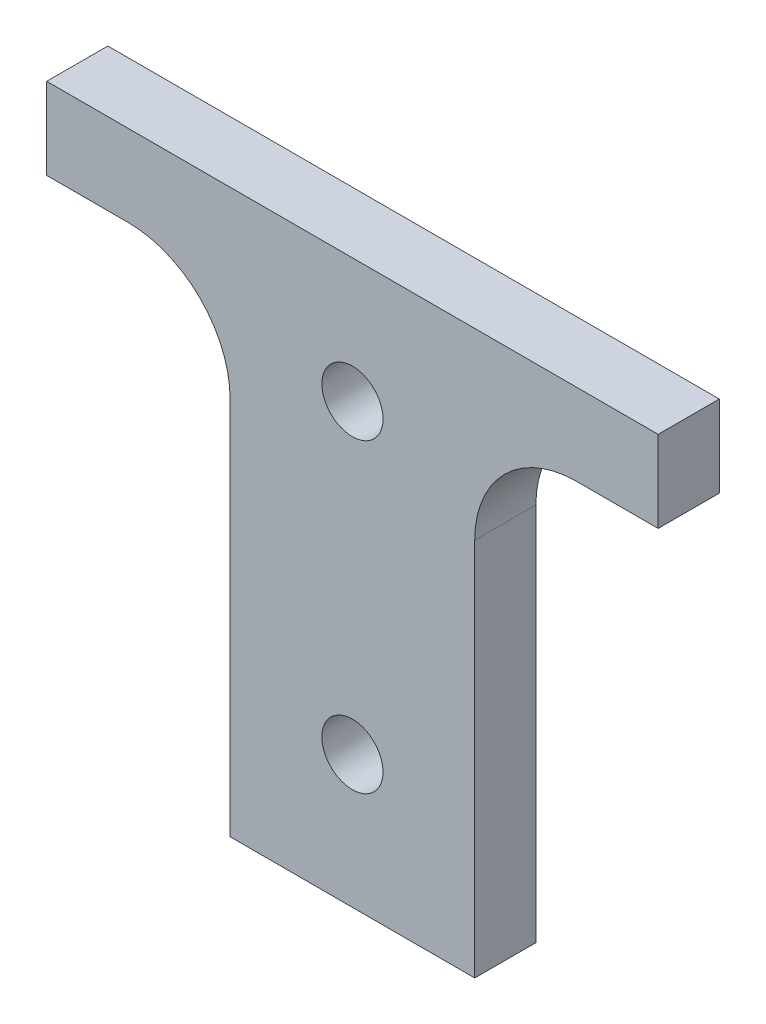
ISO-10303-21;
HEADER;
FILE_DESCRIPTION(('STEP AP214'),'2;1');
FILE_NAME('part.step','',(''),(''),'','','');
FILE_SCHEMA(('AUTOMOTIVE_DESIGN { 1 0 10303 214 1 1 1 1 }'));
ENDSEC;
DATA;
#1=APPLICATION_CONTEXT('core data for automotive mechanical design processes');
#2=APPLICATION_PROTOCOL_DEFINITION('international standard','automotive_design',2000,#1);
#3=PRODUCT_CONTEXT('',#1,'mechanical');
#4=PRODUCT('Part','Part','',(#3));
#5=PRODUCT_RELATED_PRODUCT_CATEGORY('part','',(#4));
#6=PRODUCT_DEFINITION_FORMATION('','',#4);
#7=PRODUCT_DEFINITION_CONTEXT('part definition',#1,'design');
#8=PRODUCT_DEFINITION('design','',#6,#7);
#9=PRODUCT_DEFINITION_SHAPE('','',#8);
#10=(LENGTH_UNIT() NAMED_UNIT(*) SI_UNIT(.MILLI.,.METRE.));
#11=(NAMED_UNIT(*) PLANE_ANGLE_UNIT() SI_UNIT($,.RADIAN.));
#12=(NAMED_UNIT(*) SI_UNIT($,.STERADIAN.) SOLID_ANGLE_UNIT());
#13=UNCERTAINTY_MEASURE_WITH_UNIT(LENGTH_MEASURE(1.E-05),#10,'distance_accuracy_value','');
#14=(GEOMETRIC_REPRESENTATION_CONTEXT(3) GLOBAL_UNCERTAINTY_ASSIGNED_CONTEXT((#13)) GLOBAL_UNIT_ASSIGNED_CONTEXT((#10,
#11,#12)) REPRESENTATION_CONTEXT('',''));
#15=CARTESIAN_POINT('',(0.,0.,0.));
#16=DIRECTION('',(0.,0.,1.));
#17=DIRECTION('',(1.,0.,0.));
#18=AXIS2_PLACEMENT_3D('',#15,#16,#17);
#19=CARTESIAN_POINT('',(0.,0.,3.));
#20=DIRECTION('',(0.,0.,1.));
#21=DIRECTION('',(1.,0.,0.));
#22=AXIS2_PLACEMENT_3D('',#19,#20,#21);
#23=PLANE('',#22);
#24=CARTESIAN_POINT('',(0.,6.5,3.));
#25=DIRECTION('',(0.,0.,1.));
#26=DIRECTION('',(1.,0.,0.));
#27=AXIS2_PLACEMENT_3D('',#24,#25,#26);
#28=CIRCLE('',#27,1.5);
#29=CARTESIAN_POINT('',(1.5,6.5,3.));
#30=VERTEX_POINT('',#29);
#31=EDGE_CURVE('E150',#30,#30,#28,.T.);
#32=ORIENTED_EDGE('',*,*,#31,.F.);
#33=EDGE_LOOP('',(#32));
#34=FACE_BOUND('',#33,.T.);
#35=DIRECTION('',(0.,1.,0.));
#36=VECTOR('',#35,1.);
#37=CARTESIAN_POINT('',(6.,0.,3.));
#38=LINE('',#37,#36);
#39=CARTESIAN_POINT('',(6.,0.,3.));
#40=VERTEX_POINT('',#39);
#41=CARTESIAN_POINT('',(6.,18.6,3.));
#42=VERTEX_POINT('',#41);
#43=EDGE_CURVE('E119',#40,#42,#38,.T.);
#44=ORIENTED_EDGE('',*,*,#43,.T.);
#45=CARTESIAN_POINT('',(11.,18.6,3.));
#46=DIRECTION('',(0.,0.,1.));
#47=DIRECTION('',(1.,0.,0.));
#48=AXIS2_PLACEMENT_3D('',#45,#46,#47);
#49=CIRCLE('',#48,5.);
#50=CARTESIAN_POINT('',(11.,23.6,3.));
#51=VERTEX_POINT('',#50);
#52=EDGE_CURVE('E11',#42,#51,#49,.F.);
#53=ORIENTED_EDGE('',*,*,#52,.T.);
#54=DIRECTION('',(1.,0.,0.));
#55=VECTOR('',#54,1.);
#56=CARTESIAN_POINT('',(15.,23.6,3.));
#57=LINE('',#56,#55);
#58=CARTESIAN_POINT('',(15.,23.6,3.));
#59=VERTEX_POINT('',#58);
#60=EDGE_CURVE('E109',#51,#59,#57,.T.);
#61=ORIENTED_EDGE('',*,*,#60,.T.);
#62=DIRECTION('',(0.,1.,0.));
#63=VECTOR('',#62,1.);
#64=CARTESIAN_POINT('',(15.,27.6,3.));
#65=LINE('',#64,#63);
#66=CARTESIAN_POINT('',(15.,27.6,3.));
#67=VERTEX_POINT('',#66);
#68=EDGE_CURVE('E113',#59,#67,#65,.T.);
#69=ORIENTED_EDGE('',*,*,#68,.T.);
#70=DIRECTION('',(-1.,0.,0.));
#71=VECTOR('',#70,1.);
#72=CARTESIAN_POINT('',(15.,27.6,3.));
#73=LINE('',#72,#71);
#74=CARTESIAN_POINT('',(-15.,27.6,3.));
#75=VERTEX_POINT('',#74);
#76=EDGE_CURVE('E133',#67,#75,#73,.T.);
#77=ORIENTED_EDGE('',*,*,#76,.T.);
#78=DIRECTION('',(0.,-1.,0.));
#79=VECTOR('',#78,1.);
#80=CARTESIAN_POINT('',(-15.,27.6,3.));
#81=LINE('',#80,#79);
#82=CARTESIAN_POINT('',(-15.,23.6,3.));
#83=VERTEX_POINT('',#82);
#84=EDGE_CURVE('E135',#75,#83,#81,.T.);
#85=ORIENTED_EDGE('',*,*,#84,.T.);
#86=DIRECTION('',(1.,0.,0.));
#87=VECTOR('',#86,1.);
#88=CARTESIAN_POINT('',(-15.,23.6,3.));
#89=LINE('',#88,#87);
#90=CARTESIAN_POINT('',(-11.,23.6,3.));
#91=VERTEX_POINT('',#90);
#92=EDGE_CURVE('E140',#83,#91,#89,.T.);
#93=ORIENTED_EDGE('',*,*,#92,.T.);
#94=CARTESIAN_POINT('',(-11.,18.6,3.));
#95=DIRECTION('',(0.,0.,1.));
#96=DIRECTION('',(1.,0.,0.));
#97=AXIS2_PLACEMENT_3D('',#94,#95,#96);
#98=CIRCLE('',#97,5.);
#99=CARTESIAN_POINT('',(-6.,18.6,3.));
#100=VERTEX_POINT('',#99);
#101=EDGE_CURVE('E183',#91,#100,#98,.F.);
#102=ORIENTED_EDGE('',*,*,#101,.T.);
#103=DIRECTION('',(0.,-1.,0.));
#104=VECTOR('',#103,1.);
#105=CARTESIAN_POINT('',(-6.,0.,3.));
#106=LINE('',#105,#104);
#107=CARTESIAN_POINT('',(-6.,0.,3.));
#108=VERTEX_POINT('',#107);
#109=EDGE_CURVE('E143',#100,#108,#106,.T.);
#110=ORIENTED_EDGE('',*,*,#109,.T.);
#111=DIRECTION('',(1.,0.,0.));
#112=VECTOR('',#111,1.);
#113=CARTESIAN_POINT('',(6.,0.,3.));
#114=LINE('',#113,#112);
#115=EDGE_CURVE('E145',#108,#40,#114,.T.);
#116=ORIENTED_EDGE('',*,*,#115,.T.);
#117=EDGE_LOOP('',(#44,#53,#61,#69,#77,#85,#93,#102,#110,#116));
#118=FACE_BOUND('',#117,.T.);
#119=CARTESIAN_POINT('',(0.,21.5,3.));
#120=DIRECTION('',(0.,0.,1.));
#121=DIRECTION('',(1.,0.,0.));
#122=AXIS2_PLACEMENT_3D('',#119,#120,#121);
#123=CIRCLE('',#122,1.5);
#124=CARTESIAN_POINT('',(1.5,21.5,3.));
#125=VERTEX_POINT('',#124);
#126=EDGE_CURVE('E338',#125,#125,#123,.T.);
#127=ORIENTED_EDGE('',*,*,#126,.F.);
#128=EDGE_LOOP('',(#127));
#129=FACE_BOUND('',#128,.T.);
#130=ADVANCED_FACE('F33',(#34,#118,#129),#23,.T.);
#131=CARTESIAN_POINT('',(0.,0.,0.));
#132=DIRECTION('',(0.,0.,1.));
#133=DIRECTION('',(1.,0.,0.));
#134=AXIS2_PLACEMENT_3D('',#131,#132,#133);
#135=PLANE('',#134);
#136=DIRECTION('',(0.,1.,0.));
#137=VECTOR('',#136,1.);
#138=CARTESIAN_POINT('',(6.,0.,0.));
#139=LINE('',#138,#137);
#140=CARTESIAN_POINT('',(6.,0.,0.));
#141=VERTEX_POINT('',#140);
#142=CARTESIAN_POINT('',(6.,18.6,0.));
#143=VERTEX_POINT('',#142);
#144=EDGE_CURVE('E148',#141,#143,#139,.T.);
#145=ORIENTED_EDGE('',*,*,#144,.F.);
#146=DIRECTION('',(1.,0.,0.));
#147=VECTOR('',#146,1.);
#148=CARTESIAN_POINT('',(6.,0.,0.));
#149=LINE('',#148,#147);
#150=CARTESIAN_POINT('',(-6.,0.,0.));
#151=VERTEX_POINT('',#150);
#152=EDGE_CURVE('E163',#151,#141,#149,.T.);
#153=ORIENTED_EDGE('',*,*,#152,.F.);
#154=DIRECTION('',(0.,-1.,0.));
#155=VECTOR('',#154,1.);
#156=CARTESIAN_POINT('',(-6.,0.,0.));
#157=LINE('',#156,#155);
#158=CARTESIAN_POINT('',(-6.,18.6,0.));
#159=VERTEX_POINT('',#158);
#160=EDGE_CURVE('E161',#159,#151,#157,.T.);
#161=ORIENTED_EDGE('',*,*,#160,.F.);
#162=CARTESIAN_POINT('',(-11.,18.6,0.));
#163=DIRECTION('',(0.,0.,1.));
#164=DIRECTION('',(1.,0.,0.));
#165=AXIS2_PLACEMENT_3D('',#162,#163,#164);
#166=CIRCLE('',#165,5.);
#167=CARTESIAN_POINT('',(-11.,23.6,0.));
#168=VERTEX_POINT('',#167);
#169=EDGE_CURVE('E181',#159,#168,#166,.T.);
#170=ORIENTED_EDGE('',*,*,#169,.T.);
#171=DIRECTION('',(1.,0.,0.));
#172=VECTOR('',#171,1.);
#173=CARTESIAN_POINT('',(-15.,23.6,0.));
#174=LINE('',#173,#172);
#175=CARTESIAN_POINT('',(-15.,23.6,0.));
#176=VERTEX_POINT('',#175);
#177=EDGE_CURVE('E158',#176,#168,#174,.T.);
#178=ORIENTED_EDGE('',*,*,#177,.F.);
#179=DIRECTION('',(0.,-1.,0.));
#180=VECTOR('',#179,1.);
#181=CARTESIAN_POINT('',(-15.,27.6,0.));
#182=LINE('',#181,#180);
#183=CARTESIAN_POINT('',(-15.,27.6,0.));
#184=VERTEX_POINT('',#183);
#185=EDGE_CURVE('E156',#184,#176,#182,.T.);
#186=ORIENTED_EDGE('',*,*,#185,.F.);
#187=DIRECTION('',(-1.,0.,0.));
#188=VECTOR('',#187,1.);
#189=CARTESIAN_POINT('',(15.,27.6,0.));
#190=LINE('',#189,#188);
#191=CARTESIAN_POINT('',(15.,27.6,0.));
#192=VERTEX_POINT('',#191);
#193=EDGE_CURVE('E154',#192,#184,#190,.T.);
#194=ORIENTED_EDGE('',*,*,#193,.F.);
#195=DIRECTION('',(0.,1.,0.));
#196=VECTOR('',#195,1.);
#197=CARTESIAN_POINT('',(15.,27.6,0.));
#198=LINE('',#197,#196);
#199=CARTESIAN_POINT('',(15.,23.6,0.));
#200=VERTEX_POINT('',#199);
#201=EDGE_CURVE('E152',#200,#192,#198,.T.);
#202=ORIENTED_EDGE('',*,*,#201,.F.);
#203=DIRECTION('',(1.,0.,0.));
#204=VECTOR('',#203,1.);
#205=CARTESIAN_POINT('',(15.,23.6,0.));
#206=LINE('',#205,#204);
#207=CARTESIAN_POINT('',(11.,23.6,0.));
#208=VERTEX_POINT('',#207);
#209=EDGE_CURVE('E124',#208,#200,#206,.T.);
#210=ORIENTED_EDGE('',*,*,#209,.F.);
#211=CARTESIAN_POINT('',(11.,18.6,0.));
#212=DIRECTION('',(0.,0.,1.));
#213=DIRECTION('',(1.,0.,0.));
#214=AXIS2_PLACEMENT_3D('',#211,#212,#213);
#215=CIRCLE('',#214,5.);
#216=EDGE_CURVE('E41',#208,#143,#215,.T.);
#217=ORIENTED_EDGE('',*,*,#216,.T.);
#218=EDGE_LOOP('',(#145,#153,#161,#170,#178,#186,#194,#202,#210,#217));
#219=FACE_BOUND('',#218,.T.);
#220=CARTESIAN_POINT('',(0.,6.5,0.));
#221=DIRECTION('',(0.,0.,1.));
#222=DIRECTION('',(1.,0.,0.));
#223=AXIS2_PLACEMENT_3D('',#220,#221,#222);
#224=CIRCLE('',#223,1.5);
#225=CARTESIAN_POINT('',(1.5,6.5,0.));
#226=VERTEX_POINT('',#225);
#227=EDGE_CURVE('E344',#226,#226,#224,.T.);
#228=ORIENTED_EDGE('',*,*,#227,.T.);
#229=EDGE_LOOP('',(#228));
#230=FACE_BOUND('',#229,.T.);
#231=CARTESIAN_POINT('',(0.,21.5,0.));
#232=DIRECTION('',(0.,0.,1.));
#233=DIRECTION('',(1.,0.,0.));
#234=AXIS2_PLACEMENT_3D('',#231,#232,#233);
#235=CIRCLE('',#234,1.5);
#236=CARTESIAN_POINT('',(1.5,21.5,0.));
#237=VERTEX_POINT('',#236);
#238=EDGE_CURVE('E341',#237,#237,#235,.T.);
#239=ORIENTED_EDGE('',*,*,#238,.T.);
#240=EDGE_LOOP('',(#239));
#241=FACE_BOUND('',#240,.T.);
#242=ADVANCED_FACE('F188',(#219,#230,#241),#135,.F.);
#243=CARTESIAN_POINT('',(6.,0.,3.));
#244=DIRECTION('',(-1.,0.,0.));
#245=DIRECTION('',(0.,0.,1.));
#246=AXIS2_PLACEMENT_3D('',#243,#244,#245);
#247=PLANE('',#246);
#248=ORIENTED_EDGE('',*,*,#144,.T.);
#249=DIRECTION('',(0.,0.,-1.));
#250=VECTOR('',#249,1.);
#251=CARTESIAN_POINT('',(6.,18.6,3.));
#252=LINE('',#251,#250);
#253=EDGE_CURVE('E48',#143,#42,#252,.F.);
#254=ORIENTED_EDGE('',*,*,#253,.T.);
#255=ORIENTED_EDGE('',*,*,#43,.F.);
#256=DIRECTION('',(0.,0.,-1.));
#257=VECTOR('',#256,1.);
#258=CARTESIAN_POINT('',(6.,0.,3.));
#259=LINE('',#258,#257);
#260=EDGE_CURVE('E147',#40,#141,#259,.T.);
#261=ORIENTED_EDGE('',*,*,#260,.T.);
#262=EDGE_LOOP('',(#248,#254,#255,#261));
#263=FACE_BOUND('',#262,.T.);
#264=ADVANCED_FACE('F229',(#263),#247,.F.);
#265=CARTESIAN_POINT('',(15.,23.6,3.));
#266=DIRECTION('',(0.,1.,0.));
#267=DIRECTION('',(0.,0.,1.));
#268=AXIS2_PLACEMENT_3D('',#265,#266,#267);
#269=PLANE('',#268);
#270=ORIENTED_EDGE('',*,*,#60,.F.);
#271=DIRECTION('',(0.,0.,-1.));
#272=VECTOR('',#271,1.);
#273=CARTESIAN_POINT('',(11.,23.6,0.));
#274=LINE('',#273,#272);
#275=EDGE_CURVE('E185',#51,#208,#274,.T.);
#276=ORIENTED_EDGE('',*,*,#275,.T.);
#277=ORIENTED_EDGE('',*,*,#209,.T.);
#278=DIRECTION('',(0.,0.,-1.));
#279=VECTOR('',#278,1.);
#280=CARTESIAN_POINT('',(15.,23.6,3.));
#281=LINE('',#280,#279);
#282=EDGE_CURVE('E122',#59,#200,#281,.T.);
#283=ORIENTED_EDGE('',*,*,#282,.F.);
#284=EDGE_LOOP('',(#270,#276,#277,#283));
#285=FACE_BOUND('',#284,.T.);
#286=ADVANCED_FACE('F123',(#285),#269,.F.);
#287=CARTESIAN_POINT('',(15.,27.6,3.));
#288=DIRECTION('',(-1.,0.,0.));
#289=DIRECTION('',(0.,0.,1.));
#290=AXIS2_PLACEMENT_3D('',#287,#288,#289);
#291=PLANE('',#290);
#292=ORIENTED_EDGE('',*,*,#201,.T.);
#293=DIRECTION('',(0.,0.,-1.));
#294=VECTOR('',#293,1.);
#295=CARTESIAN_POINT('',(15.,27.6,3.));
#296=LINE('',#295,#294);
#297=EDGE_CURVE('E128',#67,#192,#296,.T.);
#298=ORIENTED_EDGE('',*,*,#297,.F.);
#299=ORIENTED_EDGE('',*,*,#68,.F.);
#300=ORIENTED_EDGE('',*,*,#282,.T.);
#301=EDGE_LOOP('',(#292,#298,#299,#300));
#302=FACE_BOUND('',#301,.T.);
#303=ADVANCED_FACE('F130',(#302),#291,.F.);
#304=CARTESIAN_POINT('',(15.,27.6,3.));
#305=DIRECTION('',(0.,-1.,0.));
#306=DIRECTION('',(0.,0.,-1.));
#307=AXIS2_PLACEMENT_3D('',#304,#305,#306);
#308=PLANE('',#307);
#309=ORIENTED_EDGE('',*,*,#193,.T.);
#310=DIRECTION('',(0.,0.,-1.));
#311=VECTOR('',#310,1.);
#312=CARTESIAN_POINT('',(-15.,27.6,3.));
#313=LINE('',#312,#311);
#314=EDGE_CURVE('E173',#75,#184,#313,.T.);
#315=ORIENTED_EDGE('',*,*,#314,.F.);
#316=ORIENTED_EDGE('',*,*,#76,.F.);
#317=ORIENTED_EDGE('',*,*,#297,.T.);
#318=EDGE_LOOP('',(#309,#315,#316,#317));
#319=FACE_BOUND('',#318,.T.);
#320=ADVANCED_FACE('F193',(#319),#308,.F.);
#321=CARTESIAN_POINT('',(-15.,27.6,3.));
#322=DIRECTION('',(1.,0.,0.));
#323=DIRECTION('',(0.,0.,-1.));
#324=AXIS2_PLACEMENT_3D('',#321,#322,#323);
#325=PLANE('',#324);
#326=ORIENTED_EDGE('',*,*,#185,.T.);
#327=DIRECTION('',(0.,0.,-1.));
#328=VECTOR('',#327,1.);
#329=CARTESIAN_POINT('',(-15.,23.6,3.));
#330=LINE('',#329,#328);
#331=EDGE_CURVE('E170',#83,#176,#330,.T.);
#332=ORIENTED_EDGE('',*,*,#331,.F.);
#333=ORIENTED_EDGE('',*,*,#84,.F.);
#334=ORIENTED_EDGE('',*,*,#314,.T.);
#335=EDGE_LOOP('',(#326,#332,#333,#334));
#336=FACE_BOUND('',#335,.T.);
#337=ADVANCED_FACE('F200',(#336),#325,.F.);
#338=CARTESIAN_POINT('',(-15.,23.6,3.));
#339=DIRECTION('',(0.,1.,0.));
#340=DIRECTION('',(0.,0.,1.));
#341=AXIS2_PLACEMENT_3D('',#338,#339,#340);
#342=PLANE('',#341);
#343=ORIENTED_EDGE('',*,*,#177,.T.);
#344=DIRECTION('',(0.,0.,-1.));
#345=VECTOR('',#344,1.);
#346=CARTESIAN_POINT('',(-11.,23.6,3.));
#347=LINE('',#346,#345);
#348=EDGE_CURVE('E179',#168,#91,#347,.F.);
#349=ORIENTED_EDGE('',*,*,#348,.T.);
#350=ORIENTED_EDGE('',*,*,#92,.F.);
#351=ORIENTED_EDGE('',*,*,#331,.T.);
#352=EDGE_LOOP('',(#343,#349,#350,#351));
#353=FACE_BOUND('',#352,.T.);
#354=ADVANCED_FACE('F203',(#353),#342,.F.);
#355=CARTESIAN_POINT('',(-6.,0.,3.));
#356=DIRECTION('',(1.,0.,0.));
#357=DIRECTION('',(0.,0.,-1.));
#358=AXIS2_PLACEMENT_3D('',#355,#356,#357);
#359=PLANE('',#358);
#360=ORIENTED_EDGE('',*,*,#109,.F.);
#361=DIRECTION('',(0.,0.,-1.));
#362=VECTOR('',#361,1.);
#363=CARTESIAN_POINT('',(-6.,18.6,0.));
#364=LINE('',#363,#362);
#365=EDGE_CURVE('E127',#100,#159,#364,.T.);
#366=ORIENTED_EDGE('',*,*,#365,.T.);
#367=ORIENTED_EDGE('',*,*,#160,.T.);
#368=DIRECTION('',(0.,0.,-1.));
#369=VECTOR('',#368,1.);
#370=CARTESIAN_POINT('',(-6.,0.,3.));
#371=LINE('',#370,#369);
#372=EDGE_CURVE('E167',#108,#151,#371,.T.);
#373=ORIENTED_EDGE('',*,*,#372,.F.);
#374=EDGE_LOOP('',(#360,#366,#367,#373));
#375=FACE_BOUND('',#374,.T.);
#376=ADVANCED_FACE('F211',(#375),#359,.F.);
#377=CARTESIAN_POINT('',(6.,0.,3.));
#378=DIRECTION('',(0.,1.,0.));
#379=DIRECTION('',(0.,0.,1.));
#380=AXIS2_PLACEMENT_3D('',#377,#378,#379);
#381=PLANE('',#380);
#382=ORIENTED_EDGE('',*,*,#152,.T.);
#383=ORIENTED_EDGE('',*,*,#260,.F.);
#384=ORIENTED_EDGE('',*,*,#115,.F.);
#385=ORIENTED_EDGE('',*,*,#372,.T.);
#386=EDGE_LOOP('',(#382,#383,#384,#385));
#387=FACE_BOUND('',#386,.T.);
#388=ADVANCED_FACE('F217',(#387),#381,.F.);
#389=CARTESIAN_POINT('',(0.,6.5,3.));
#390=DIRECTION('',(0.,0.,-1.));
#391=DIRECTION('',(-1.,0.,0.));
#392=AXIS2_PLACEMENT_3D('',#389,#390,#391);
#393=CYLINDRICAL_SURFACE('',#392,1.5);
#394=ORIENTED_EDGE('',*,*,#31,.T.);
#395=EDGE_LOOP('',(#394));
#396=FACE_BOUND('',#395,.T.);
#397=ORIENTED_EDGE('',*,*,#227,.F.);
#398=EDGE_LOOP('',(#397));
#399=FACE_BOUND('',#398,.T.);
#400=ADVANCED_FACE('F233',(#396,#399),#393,.F.);
#401=CARTESIAN_POINT('',(0.,21.5,3.));
#402=DIRECTION('',(0.,0.,-1.));
#403=DIRECTION('',(-1.,0.,0.));
#404=AXIS2_PLACEMENT_3D('',#401,#402,#403);
#405=CYLINDRICAL_SURFACE('',#404,1.5);
#406=ORIENTED_EDGE('',*,*,#126,.T.);
#407=EDGE_LOOP('',(#406));
#408=FACE_BOUND('',#407,.T.);
#409=ORIENTED_EDGE('',*,*,#238,.F.);
#410=EDGE_LOOP('',(#409));
#411=FACE_BOUND('',#410,.T.);
#412=ADVANCED_FACE('F222',(#408,#411),#405,.F.);
#413=CARTESIAN_POINT('',(-11.,18.6,3.));
#414=DIRECTION('',(0.,0.,1.));
#415=DIRECTION('',(1.,0.,0.));
#416=AXIS2_PLACEMENT_3D('',#413,#414,#415);
#417=CYLINDRICAL_SURFACE('',#416,5.);
#418=ORIENTED_EDGE('',*,*,#101,.F.);
#419=ORIENTED_EDGE('',*,*,#348,.F.);
#420=ORIENTED_EDGE('',*,*,#169,.F.);
#421=ORIENTED_EDGE('',*,*,#365,.F.);
#422=EDGE_LOOP('',(#418,#419,#420,#421));
#423=FACE_BOUND('',#422,.T.);
#424=ADVANCED_FACE('F206',(#423),#417,.F.);
#425=CARTESIAN_POINT('',(11.,18.6,3.));
#426=DIRECTION('',(0.,0.,1.));
#427=DIRECTION('',(1.,0.,0.));
#428=AXIS2_PLACEMENT_3D('',#425,#426,#427);
#429=CYLINDRICAL_SURFACE('',#428,5.);
#430=ORIENTED_EDGE('',*,*,#52,.F.);
#431=ORIENTED_EDGE('',*,*,#253,.F.);
#432=ORIENTED_EDGE('',*,*,#216,.F.);
#433=ORIENTED_EDGE('',*,*,#275,.F.);
#434=EDGE_LOOP('',(#430,#431,#432,#433));
#435=FACE_BOUND('',#434,.T.);
#436=ADVANCED_FACE('F35',(#435),#429,.F.);
#437=CLOSED_SHELL('',(#130,#242,#264,#286,#303,#320,#337,#354,#376,#388,#400,#412,#424,#436));
#438=MANIFOLD_SOLID_BREP('B2',#437);
#439=ADVANCED_BREP_SHAPE_REPRESENTATION('',(#18,#438),#14);
#440=SHAPE_DEFINITION_REPRESENTATION(#9,#439);
ENDSEC;
END-ISO-10303-21;
